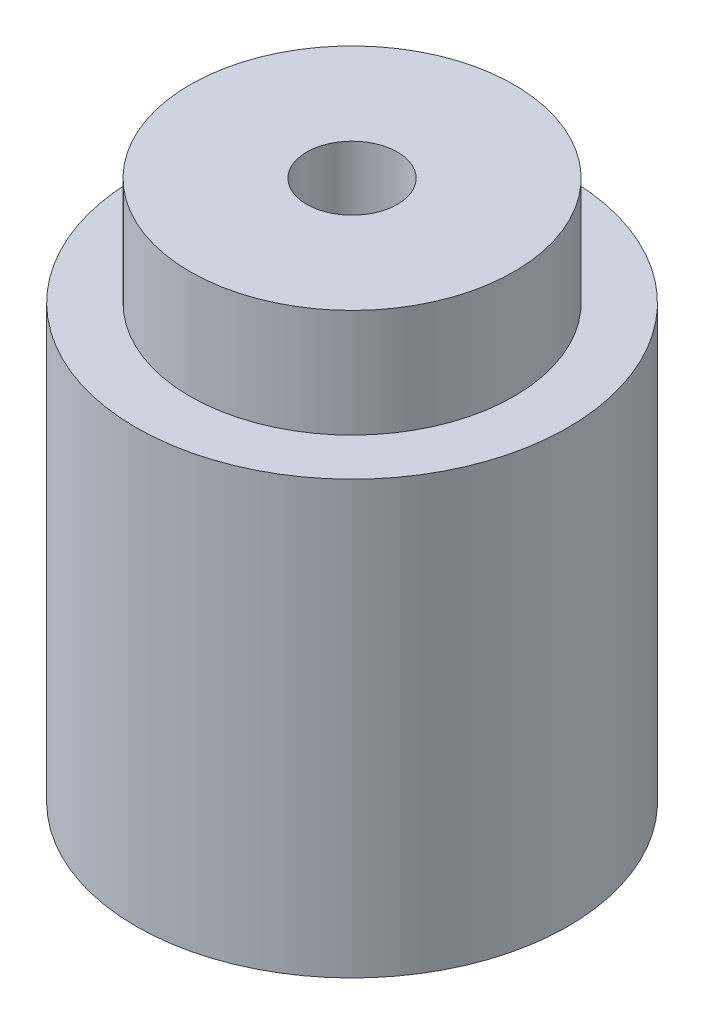
ISO-10303-21;
HEADER;
FILE_DESCRIPTION(('STEP AP214'),'2;1');
FILE_NAME('part.step','',(''),(''),'','','');
FILE_SCHEMA(('AUTOMOTIVE_DESIGN { 1 0 10303 214 1 1 1 1 }'));
ENDSEC;
DATA;
#1=APPLICATION_CONTEXT('core data for automotive mechanical design processes');
#2=APPLICATION_PROTOCOL_DEFINITION('international standard','automotive_design',2000,#1);
#3=PRODUCT_CONTEXT('',#1,'mechanical');
#4=PRODUCT('Part','Part','',(#3));
#5=PRODUCT_RELATED_PRODUCT_CATEGORY('part','',(#4));
#6=PRODUCT_DEFINITION_FORMATION('','',#4);
#7=PRODUCT_DEFINITION_CONTEXT('part definition',#1,'design');
#8=PRODUCT_DEFINITION('design','',#6,#7);
#9=PRODUCT_DEFINITION_SHAPE('','',#8);
#10=(LENGTH_UNIT() NAMED_UNIT(*) SI_UNIT(.MILLI.,.METRE.));
#11=(NAMED_UNIT(*) PLANE_ANGLE_UNIT() SI_UNIT($,.RADIAN.));
#12=(NAMED_UNIT(*) SI_UNIT($,.STERADIAN.) SOLID_ANGLE_UNIT());
#13=UNCERTAINTY_MEASURE_WITH_UNIT(LENGTH_MEASURE(1.E-05),#10,'distance_accuracy_value','');
#14=(GEOMETRIC_REPRESENTATION_CONTEXT(3) GLOBAL_UNCERTAINTY_ASSIGNED_CONTEXT((#13)) GLOBAL_UNIT_ASSIGNED_CONTEXT((#10,
#11,#12)) REPRESENTATION_CONTEXT('',''));
#15=CARTESIAN_POINT('',(0.,0.,0.));
#16=DIRECTION('',(0.,0.,1.));
#17=DIRECTION('',(1.,0.,0.));
#18=AXIS2_PLACEMENT_3D('',#15,#16,#17);
#19=CARTESIAN_POINT('',(0.,25.,0.));
#20=DIRECTION('',(0.,1.,0.));
#21=DIRECTION('',(0.,0.,1.));
#22=AXIS2_PLACEMENT_3D('',#19,#20,#21);
#23=PLANE('',#22);
#24=CARTESIAN_POINT('',(0.,25.,0.));
#25=DIRECTION('',(0.,1.,0.));
#26=DIRECTION('',(0.,0.,1.));
#27=AXIS2_PLACEMENT_3D('',#24,#25,#26);
#28=CIRCLE('',#27,2.1);
#29=CARTESIAN_POINT('',(0.,25.,2.1));
#30=VERTEX_POINT('',#29);
#31=EDGE_CURVE('E66',#30,#30,#28,.T.);
#32=ORIENTED_EDGE('',*,*,#31,.F.);
#33=EDGE_LOOP('',(#32));
#34=FACE_BOUND('',#33,.T.);
#35=CARTESIAN_POINT('',(0.,25.,0.));
#36=DIRECTION('',(0.,1.,0.));
#37=DIRECTION('',(0.,0.,1.));
#38=AXIS2_PLACEMENT_3D('',#35,#36,#37);
#39=CIRCLE('',#38,7.5);
#40=CARTESIAN_POINT('',(0.,25.,7.5));
#41=VERTEX_POINT('',#40);
#42=EDGE_CURVE('E77',#41,#41,#39,.T.);
#43=ORIENTED_EDGE('',*,*,#42,.T.);
#44=EDGE_LOOP('',(#43));
#45=FACE_BOUND('',#44,.T.);
#46=ADVANCED_FACE('F46',(#34,#45),#23,.T.);
#47=CARTESIAN_POINT('',(0.,11.2618072999579,0.));
#48=DIRECTION('',(0.,1.,0.));
#49=DIRECTION('',(0.,0.,1.));
#50=AXIS2_PLACEMENT_3D('',#47,#48,#49);
#51=CONICAL_SURFACE('',#50,2.1,1.02974425867665);
#52=CARTESIAN_POINT('',(0.,10.,0.));
#53=VERTEX_POINT('',#52);
#54=VERTEX_LOOP('',#53);
#55=FACE_BOUND('',#54,.T.);
#56=CARTESIAN_POINT('',(0.,11.2618072999579,0.));
#57=DIRECTION('',(0.,1.,0.));
#58=DIRECTION('',(0.,0.,1.));
#59=AXIS2_PLACEMENT_3D('',#56,#57,#58);
#60=CIRCLE('',#59,2.1);
#61=CARTESIAN_POINT('',(0.,11.2618072999579,2.1));
#62=VERTEX_POINT('',#61);
#63=EDGE_CURVE('E54',#62,#62,#60,.T.);
#64=ORIENTED_EDGE('',*,*,#63,.T.);
#65=EDGE_LOOP('',(#64));
#66=FACE_BOUND('',#65,.T.);
#67=ADVANCED_FACE('F57',(#55,#66),#51,.F.);
#68=CARTESIAN_POINT('',(0.,25.,0.));
#69=DIRECTION('',(0.,1.,0.));
#70=DIRECTION('',(0.,0.,1.));
#71=AXIS2_PLACEMENT_3D('',#68,#69,#70);
#72=CYLINDRICAL_SURFACE('',#71,2.1);
#73=ORIENTED_EDGE('',*,*,#63,.F.);
#74=EDGE_LOOP('',(#73));
#75=FACE_BOUND('',#74,.T.);
#76=ORIENTED_EDGE('',*,*,#31,.T.);
#77=EDGE_LOOP('',(#76));
#78=FACE_BOUND('',#77,.T.);
#79=ADVANCED_FACE('F60',(#75,#78),#72,.F.);
#80=CARTESIAN_POINT('',(0.,20.,0.));
#81=DIRECTION('',(0.,1.,0.));
#82=DIRECTION('',(0.,0.,1.));
#83=AXIS2_PLACEMENT_3D('',#80,#81,#82);
#84=PLANE('',#83);
#85=CARTESIAN_POINT('',(0.,20.,0.));
#86=DIRECTION('',(0.,1.,0.));
#87=DIRECTION('',(0.,0.,1.));
#88=AXIS2_PLACEMENT_3D('',#85,#86,#87);
#89=CIRCLE('',#88,7.5);
#90=CARTESIAN_POINT('',(0.,20.,7.5));
#91=VERTEX_POINT('',#90);
#92=EDGE_CURVE('E76',#91,#91,#89,.T.);
#93=ORIENTED_EDGE('',*,*,#92,.F.);
#94=EDGE_LOOP('',(#93));
#95=FACE_BOUND('',#94,.T.);
#96=CARTESIAN_POINT('',(0.,20.,0.));
#97=DIRECTION('',(0.,1.,0.));
#98=DIRECTION('',(0.,0.,1.));
#99=AXIS2_PLACEMENT_3D('',#96,#97,#98);
#100=CIRCLE('',#99,10.);
#101=CARTESIAN_POINT('',(0.,20.,10.));
#102=VERTEX_POINT('',#101);
#103=EDGE_CURVE('E70',#102,#102,#100,.T.);
#104=ORIENTED_EDGE('',*,*,#103,.T.);
#105=EDGE_LOOP('',(#104));
#106=FACE_BOUND('',#105,.T.);
#107=ADVANCED_FACE('F89',(#95,#106),#84,.T.);
#108=CARTESIAN_POINT('',(0.,20.,0.));
#109=DIRECTION('',(0.,1.,0.));
#110=DIRECTION('',(0.,0.,1.));
#111=AXIS2_PLACEMENT_3D('',#108,#109,#110);
#112=CYLINDRICAL_SURFACE('',#111,7.5);
#113=ORIENTED_EDGE('',*,*,#92,.T.);
#114=EDGE_LOOP('',(#113));
#115=FACE_BOUND('',#114,.T.);
#116=ORIENTED_EDGE('',*,*,#42,.F.);
#117=EDGE_LOOP('',(#116));
#118=FACE_BOUND('',#117,.T.);
#119=ADVANCED_FACE('F86',(#115,#118),#112,.T.);
#120=CARTESIAN_POINT('',(0.,0.,0.));
#121=DIRECTION('',(0.,1.,0.));
#122=DIRECTION('',(0.,0.,1.));
#123=AXIS2_PLACEMENT_3D('',#120,#121,#122);
#124=PLANE('',#123);
#125=CARTESIAN_POINT('',(0.,0.,0.));
#126=DIRECTION('',(0.,1.,0.));
#127=DIRECTION('',(0.,0.,1.));
#128=AXIS2_PLACEMENT_3D('',#125,#126,#127);
#129=CIRCLE('',#128,10.);
#130=CARTESIAN_POINT('',(0.,0.,10.));
#131=VERTEX_POINT('',#130);
#132=EDGE_CURVE('E11',#131,#131,#129,.T.);
#133=ORIENTED_EDGE('',*,*,#132,.F.);
#134=EDGE_LOOP('',(#133));
#135=FACE_BOUND('',#134,.T.);
#136=ADVANCED_FACE('F96',(#135),#124,.F.);
#137=CARTESIAN_POINT('',(0.,25.,0.));
#138=DIRECTION('',(0.,-1.,0.));
#139=DIRECTION('',(0.,0.,-1.));
#140=AXIS2_PLACEMENT_3D('',#137,#138,#139);
#141=CYLINDRICAL_SURFACE('',#140,10.);
#142=ORIENTED_EDGE('',*,*,#132,.T.);
#143=EDGE_LOOP('',(#142));
#144=FACE_BOUND('',#143,.T.);
#145=ORIENTED_EDGE('',*,*,#103,.F.);
#146=EDGE_LOOP('',(#145));
#147=FACE_BOUND('',#146,.T.);
#148=ADVANCED_FACE('F48',(#144,#147),#141,.T.);
#149=CLOSED_SHELL('',(#46,#67,#79,#107,#119,#136,#148));
#150=MANIFOLD_SOLID_BREP('B2',#149);
#151=ADVANCED_BREP_SHAPE_REPRESENTATION('',(#18,#150),#14);
#152=SHAPE_DEFINITION_REPRESENTATION(#9,#151);
ENDSEC;
END-ISO-10303-21;
